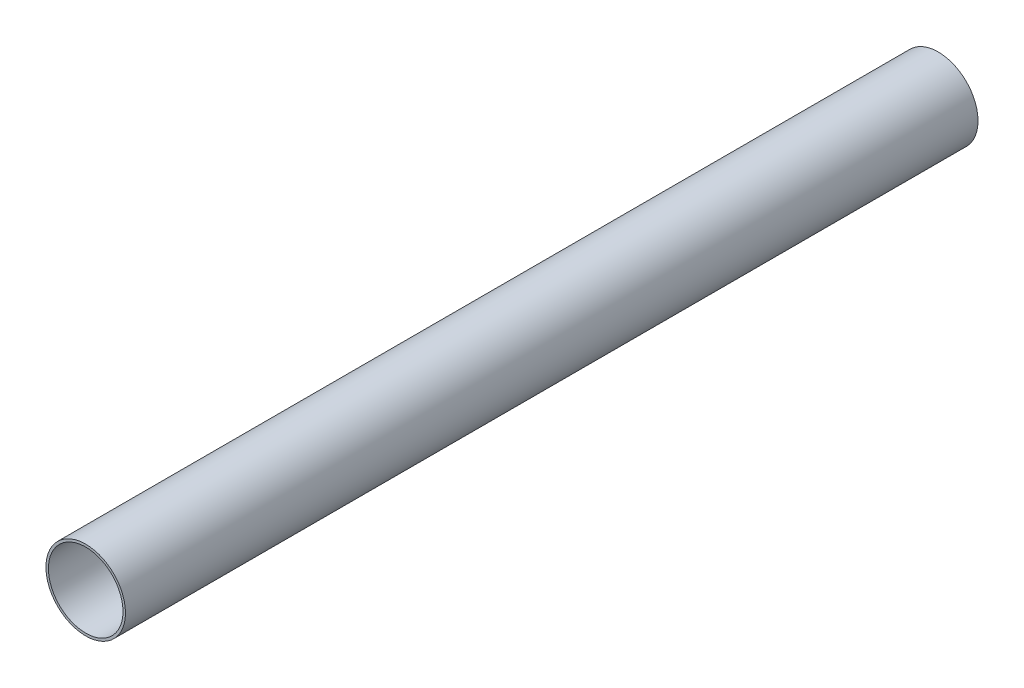
ISO-10303-21;
HEADER;
FILE_DESCRIPTION(('STEP AP214'),'2;1');
FILE_NAME('part.step','',(''),(''),'','','');
FILE_SCHEMA(('AUTOMOTIVE_DESIGN { 1 0 10303 214 1 1 1 1 }'));
ENDSEC;
DATA;
#1=APPLICATION_CONTEXT('core data for automotive mechanical design processes');
#2=APPLICATION_PROTOCOL_DEFINITION('international standard','automotive_design',2000,#1);
#3=PRODUCT_CONTEXT('',#1,'mechanical');
#4=PRODUCT('Part','Part','',(#3));
#5=PRODUCT_RELATED_PRODUCT_CATEGORY('part','',(#4));
#6=PRODUCT_DEFINITION_FORMATION('','',#4);
#7=PRODUCT_DEFINITION_CONTEXT('part definition',#1,'design');
#8=PRODUCT_DEFINITION('design','',#6,#7);
#9=PRODUCT_DEFINITION_SHAPE('','',#8);
#10=(LENGTH_UNIT() NAMED_UNIT(*) SI_UNIT(.MILLI.,.METRE.));
#11=(NAMED_UNIT(*) PLANE_ANGLE_UNIT() SI_UNIT($,.RADIAN.));
#12=(NAMED_UNIT(*) SI_UNIT($,.STERADIAN.) SOLID_ANGLE_UNIT());
#13=UNCERTAINTY_MEASURE_WITH_UNIT(LENGTH_MEASURE(1.E-05),#10,'distance_accuracy_value','');
#14=(GEOMETRIC_REPRESENTATION_CONTEXT(3) GLOBAL_UNCERTAINTY_ASSIGNED_CONTEXT((#13)) GLOBAL_UNIT_ASSIGNED_CONTEXT((#10,
#11,#12)) REPRESENTATION_CONTEXT('',''));
#15=CARTESIAN_POINT('',(0.,0.,0.));
#16=DIRECTION('',(0.,0.,1.));
#17=DIRECTION('',(1.,0.,0.));
#18=AXIS2_PLACEMENT_3D('',#15,#16,#17);
#19=CARTESIAN_POINT('',(0.,0.,508.));
#20=DIRECTION('',(0.,0.,1.));
#21=DIRECTION('',(1.,0.,0.));
#22=AXIS2_PLACEMENT_3D('',#19,#20,#21);
#23=PLANE('',#22);
#24=CARTESIAN_POINT('',(0.,0.,508.));
#25=DIRECTION('',(0.,0.,1.));
#26=DIRECTION('',(1.,0.,0.));
#27=AXIS2_PLACEMENT_3D('',#24,#25,#26);
#28=CIRCLE('',#27,23.6982);
#29=CARTESIAN_POINT('',(23.6982,0.,508.));
#30=VERTEX_POINT('',#29);
#31=EDGE_CURVE('E10',#30,#30,#28,.T.);
#32=ORIENTED_EDGE('',*,*,#31,.T.);
#33=EDGE_LOOP('',(#32));
#34=FACE_BOUND('',#33,.T.);
#35=CARTESIAN_POINT('',(0.,0.,508.));
#36=DIRECTION('',(0.,0.,1.));
#37=DIRECTION('',(1.,0.,0.));
#38=AXIS2_PLACEMENT_3D('',#35,#36,#37);
#39=CIRCLE('',#38,22.225);
#40=CARTESIAN_POINT('',(22.225,0.,508.));
#41=VERTEX_POINT('',#40);
#42=EDGE_CURVE('E41',#41,#41,#39,.T.);
#43=ORIENTED_EDGE('',*,*,#42,.F.);
#44=EDGE_LOOP('',(#43));
#45=FACE_BOUND('',#44,.T.);
#46=ADVANCED_FACE('F30',(#34,#45),#23,.T.);
#47=CARTESIAN_POINT('',(0.,0.,0.));
#48=DIRECTION('',(0.,0.,1.));
#49=DIRECTION('',(1.,0.,0.));
#50=AXIS2_PLACEMENT_3D('',#47,#48,#49);
#51=PLANE('',#50);
#52=CARTESIAN_POINT('',(0.,0.,0.));
#53=DIRECTION('',(0.,0.,1.));
#54=DIRECTION('',(1.,0.,0.));
#55=AXIS2_PLACEMENT_3D('',#52,#53,#54);
#56=CIRCLE('',#55,23.6982);
#57=CARTESIAN_POINT('',(23.6982,0.,0.));
#58=VERTEX_POINT('',#57);
#59=EDGE_CURVE('E34',#58,#58,#56,.T.);
#60=ORIENTED_EDGE('',*,*,#59,.F.);
#61=EDGE_LOOP('',(#60));
#62=FACE_BOUND('',#61,.T.);
#63=CARTESIAN_POINT('',(0.,0.,0.));
#64=DIRECTION('',(0.,0.,1.));
#65=DIRECTION('',(1.,0.,0.));
#66=AXIS2_PLACEMENT_3D('',#63,#64,#65);
#67=CIRCLE('',#66,22.225);
#68=CARTESIAN_POINT('',(22.225,0.,0.));
#69=VERTEX_POINT('',#68);
#70=EDGE_CURVE('E43',#69,#69,#67,.T.);
#71=ORIENTED_EDGE('',*,*,#70,.T.);
#72=EDGE_LOOP('',(#71));
#73=FACE_BOUND('',#72,.T.);
#74=ADVANCED_FACE('F53',(#62,#73),#51,.F.);
#75=CARTESIAN_POINT('',(0.,0.,508.));
#76=DIRECTION('',(0.,0.,-1.));
#77=DIRECTION('',(-1.,0.,0.));
#78=AXIS2_PLACEMENT_3D('',#75,#76,#77);
#79=CYLINDRICAL_SURFACE('',#78,23.6982);
#80=ORIENTED_EDGE('',*,*,#31,.F.);
#81=EDGE_LOOP('',(#80));
#82=FACE_BOUND('',#81,.T.);
#83=ORIENTED_EDGE('',*,*,#59,.T.);
#84=EDGE_LOOP('',(#83));
#85=FACE_BOUND('',#84,.T.);
#86=ADVANCED_FACE('F32',(#82,#85),#79,.T.);
#87=CARTESIAN_POINT('',(0.,0.,508.));
#88=DIRECTION('',(0.,0.,-1.));
#89=DIRECTION('',(-1.,0.,0.));
#90=AXIS2_PLACEMENT_3D('',#87,#88,#89);
#91=CYLINDRICAL_SURFACE('',#90,22.225);
#92=ORIENTED_EDGE('',*,*,#42,.T.);
#93=EDGE_LOOP('',(#92));
#94=FACE_BOUND('',#93,.T.);
#95=ORIENTED_EDGE('',*,*,#70,.F.);
#96=EDGE_LOOP('',(#95));
#97=FACE_BOUND('',#96,.T.);
#98=ADVANCED_FACE('F49',(#94,#97),#91,.F.);
#99=CLOSED_SHELL('',(#46,#74,#86,#98));
#100=MANIFOLD_SOLID_BREP('B2',#99);
#101=ADVANCED_BREP_SHAPE_REPRESENTATION('',(#18,#100),#14);
#102=SHAPE_DEFINITION_REPRESENTATION(#9,#101);
ENDSEC;
END-ISO-10303-21;
